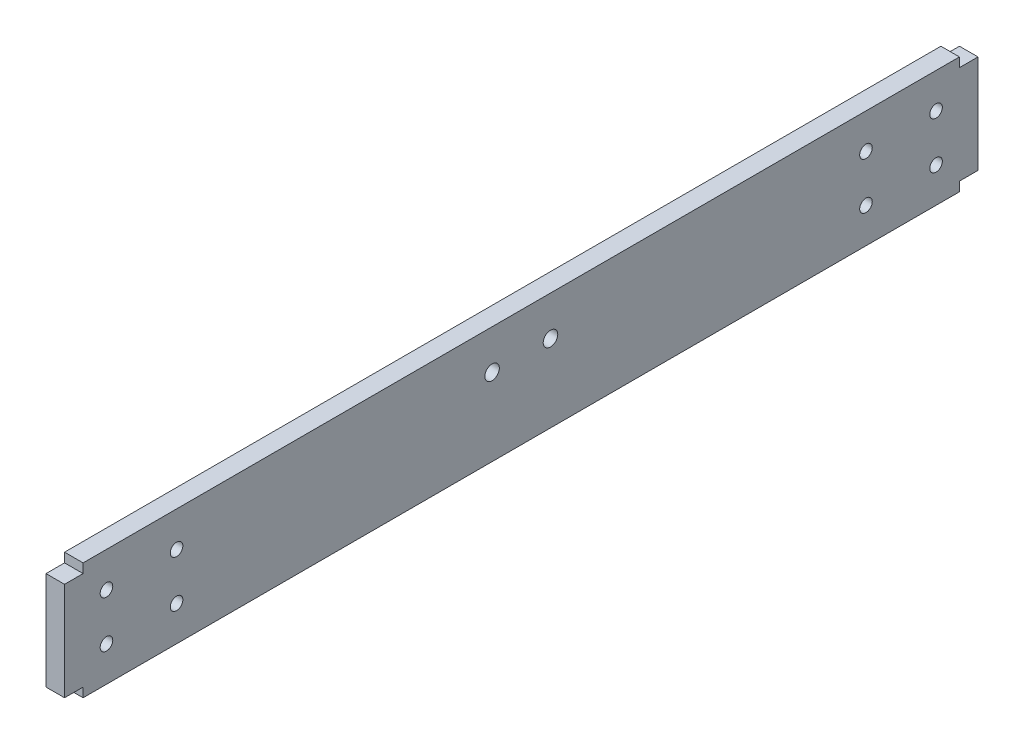
ISO-10303-21;
HEADER;
FILE_DESCRIPTION(('STEP AP214'),'2;1');
FILE_NAME('part.step','',(''),(''),'','','');
FILE_SCHEMA(('AUTOMOTIVE_DESIGN { 1 0 10303 214 1 1 1 1 }'));
ENDSEC;
DATA;
#1=APPLICATION_CONTEXT('core data for automotive mechanical design processes');
#2=APPLICATION_PROTOCOL_DEFINITION('international standard','automotive_design',2000,#1);
#3=PRODUCT_CONTEXT('',#1,'mechanical');
#4=PRODUCT('Part','Part','',(#3));
#5=PRODUCT_RELATED_PRODUCT_CATEGORY('part','',(#4));
#6=PRODUCT_DEFINITION_FORMATION('','',#4);
#7=PRODUCT_DEFINITION_CONTEXT('part definition',#1,'design');
#8=PRODUCT_DEFINITION('design','',#6,#7);
#9=PRODUCT_DEFINITION_SHAPE('','',#8);
#10=(LENGTH_UNIT() NAMED_UNIT(*) SI_UNIT(.MILLI.,.METRE.));
#11=(NAMED_UNIT(*) PLANE_ANGLE_UNIT() SI_UNIT($,.RADIAN.));
#12=(NAMED_UNIT(*) SI_UNIT($,.STERADIAN.) SOLID_ANGLE_UNIT());
#13=UNCERTAINTY_MEASURE_WITH_UNIT(LENGTH_MEASURE(1.E-05),#10,'distance_accuracy_value','');
#14=(GEOMETRIC_REPRESENTATION_CONTEXT(3) GLOBAL_UNCERTAINTY_ASSIGNED_CONTEXT((#13)) GLOBAL_UNIT_ASSIGNED_CONTEXT((#10,
#11,#12)) REPRESENTATION_CONTEXT('',''));
#15=CARTESIAN_POINT('',(0.,0.,0.));
#16=DIRECTION('',(0.,0.,1.));
#17=DIRECTION('',(1.,0.,0.));
#18=AXIS2_PLACEMENT_3D('',#15,#16,#17);
#19=CARTESIAN_POINT('',(6.35,-20.,-150.));
#20=DIRECTION('',(0.,0.,1.));
#21=DIRECTION('',(1.,0.,0.));
#22=AXIS2_PLACEMENT_3D('',#19,#20,#21);
#23=PLANE('',#22);
#24=DIRECTION('',(1.,0.,0.));
#25=VECTOR('',#24,1.);
#26=CARTESIAN_POINT('',(0.,16.825,-150.));
#27=LINE('',#26,#25);
#28=CARTESIAN_POINT('',(0.,16.825,-150.));
#29=VERTEX_POINT('',#28);
#30=CARTESIAN_POINT('',(6.35,16.825,-150.));
#31=VERTEX_POINT('',#30);
#32=EDGE_CURVE('E133',#29,#31,#27,.T.);
#33=ORIENTED_EDGE('',*,*,#32,.F.);
#34=DIRECTION('',(0.,1.,0.));
#35=VECTOR('',#34,1.);
#36=CARTESIAN_POINT('',(0.,-20.,-150.));
#37=LINE('',#36,#35);
#38=CARTESIAN_POINT('',(0.,20.,-150.));
#39=VERTEX_POINT('',#38);
#40=EDGE_CURVE('E145',#29,#39,#37,.T.);
#41=ORIENTED_EDGE('',*,*,#40,.T.);
#42=DIRECTION('',(-1.,0.,0.));
#43=VECTOR('',#42,1.);
#44=CARTESIAN_POINT('',(6.35,20.,-150.));
#45=LINE('',#44,#43);
#46=CARTESIAN_POINT('',(6.35,20.,-150.));
#47=VERTEX_POINT('',#46);
#48=EDGE_CURVE('E41',#47,#39,#45,.T.);
#49=ORIENTED_EDGE('',*,*,#48,.F.);
#50=DIRECTION('',(0.,1.,0.));
#51=VECTOR('',#50,1.);
#52=CARTESIAN_POINT('',(6.35,-20.,-150.));
#53=LINE('',#52,#51);
#54=EDGE_CURVE('E309',#31,#47,#53,.T.);
#55=ORIENTED_EDGE('',*,*,#54,.F.);
#56=EDGE_LOOP('',(#33,#41,#49,#55));
#57=FACE_BOUND('',#56,.T.);
#58=ADVANCED_FACE('F32',(#57),#23,.F.);
#59=CARTESIAN_POINT('',(6.35,-20.,150.));
#60=DIRECTION('',(0.,0.,-1.));
#61=DIRECTION('',(-1.,0.,0.));
#62=AXIS2_PLACEMENT_3D('',#59,#60,#61);
#63=PLANE('',#62);
#64=DIRECTION('',(1.,0.,0.));
#65=VECTOR('',#64,1.);
#66=CARTESIAN_POINT('',(0.,-16.825,150.));
#67=LINE('',#66,#65);
#68=CARTESIAN_POINT('',(0.,-16.825,150.));
#69=VERTEX_POINT('',#68);
#70=CARTESIAN_POINT('',(6.35,-16.825,150.));
#71=VERTEX_POINT('',#70);
#72=EDGE_CURVE('E322',#69,#71,#67,.T.);
#73=ORIENTED_EDGE('',*,*,#72,.F.);
#74=DIRECTION('',(0.,-1.,0.));
#75=VECTOR('',#74,1.);
#76=CARTESIAN_POINT('',(0.,-20.,150.));
#77=LINE('',#76,#75);
#78=CARTESIAN_POINT('',(0.,-20.,150.));
#79=VERTEX_POINT('',#78);
#80=EDGE_CURVE('E256',#69,#79,#77,.T.);
#81=ORIENTED_EDGE('',*,*,#80,.T.);
#82=DIRECTION('',(-1.,0.,0.));
#83=VECTOR('',#82,1.);
#84=CARTESIAN_POINT('',(6.35,-20.,150.));
#85=LINE('',#84,#83);
#86=CARTESIAN_POINT('',(6.35,-20.,150.));
#87=VERTEX_POINT('',#86);
#88=EDGE_CURVE('E272',#87,#79,#85,.T.);
#89=ORIENTED_EDGE('',*,*,#88,.F.);
#90=DIRECTION('',(0.,-1.,0.));
#91=VECTOR('',#90,1.);
#92=CARTESIAN_POINT('',(6.35,-20.,150.));
#93=LINE('',#92,#91);
#94=EDGE_CURVE('E294',#71,#87,#93,.T.);
#95=ORIENTED_EDGE('',*,*,#94,.F.);
#96=EDGE_LOOP('',(#73,#81,#89,#95));
#97=FACE_BOUND('',#96,.T.);
#98=ADVANCED_FACE('F230',(#97),#63,.F.);
#99=CARTESIAN_POINT('',(6.35,-20.,150.));
#100=DIRECTION('',(0.,1.,0.));
#101=DIRECTION('',(0.,0.,1.));
#102=AXIS2_PLACEMENT_3D('',#99,#100,#101);
#103=PLANE('',#102);
#104=DIRECTION('',(0.,0.,-1.));
#105=VECTOR('',#104,1.);
#106=CARTESIAN_POINT('',(0.,-20.,150.));
#107=LINE('',#106,#105);
#108=CARTESIAN_POINT('',(0.,-20.,-150.));
#109=VERTEX_POINT('',#108);
#110=EDGE_CURVE('E258',#79,#109,#107,.T.);
#111=ORIENTED_EDGE('',*,*,#110,.T.);
#112=DIRECTION('',(-1.,0.,0.));
#113=VECTOR('',#112,1.);
#114=CARTESIAN_POINT('',(6.35,-20.,-150.));
#115=LINE('',#114,#113);
#116=CARTESIAN_POINT('',(6.35,-20.,-150.));
#117=VERTEX_POINT('',#116);
#118=EDGE_CURVE('E11',#117,#109,#115,.T.);
#119=ORIENTED_EDGE('',*,*,#118,.F.);
#120=DIRECTION('',(0.,0.,-1.));
#121=VECTOR('',#120,1.);
#122=CARTESIAN_POINT('',(6.35,-20.,150.));
#123=LINE('',#122,#121);
#124=EDGE_CURVE('E280',#87,#117,#123,.T.);
#125=ORIENTED_EDGE('',*,*,#124,.F.);
#126=ORIENTED_EDGE('',*,*,#88,.T.);
#127=EDGE_LOOP('',(#111,#119,#125,#126));
#128=FACE_BOUND('',#127,.T.);
#129=ADVANCED_FACE('F34',(#128),#103,.F.);
#130=CARTESIAN_POINT('',(0.,-16.825,-150.));
#131=VERTEX_POINT('',#130);
#132=EDGE_CURVE('E250',#109,#131,#37,.T.);
#133=ORIENTED_EDGE('',*,*,#132,.T.);
#134=DIRECTION('',(1.,0.,0.));
#135=VECTOR('',#134,1.);
#136=CARTESIAN_POINT('',(0.,-16.825,-150.));
#137=LINE('',#136,#135);
#138=CARTESIAN_POINT('',(6.35,-16.825,-150.));
#139=VERTEX_POINT('',#138);
#140=EDGE_CURVE('E159',#131,#139,#137,.T.);
#141=ORIENTED_EDGE('',*,*,#140,.T.);
#142=EDGE_CURVE('E303',#117,#139,#53,.T.);
#143=ORIENTED_EDGE('',*,*,#142,.F.);
#144=ORIENTED_EDGE('',*,*,#118,.T.);
#145=EDGE_LOOP('',(#133,#141,#143,#144));
#146=FACE_BOUND('',#145,.T.);
#147=ADVANCED_FACE('F232',(#146),#23,.F.);
#148=CARTESIAN_POINT('',(6.35,20.,150.));
#149=DIRECTION('',(0.,-1.,0.));
#150=DIRECTION('',(0.,0.,-1.));
#151=AXIS2_PLACEMENT_3D('',#148,#149,#150);
#152=PLANE('',#151);
#153=DIRECTION('',(0.,0.,1.));
#154=VECTOR('',#153,1.);
#155=CARTESIAN_POINT('',(0.,20.,150.));
#156=LINE('',#155,#154);
#157=CARTESIAN_POINT('',(0.,20.,150.));
#158=VERTEX_POINT('',#157);
#159=EDGE_CURVE('E254',#39,#158,#156,.T.);
#160=ORIENTED_EDGE('',*,*,#159,.T.);
#161=DIRECTION('',(-1.,0.,0.));
#162=VECTOR('',#161,1.);
#163=CARTESIAN_POINT('',(6.35,20.,150.));
#164=LINE('',#163,#162);
#165=CARTESIAN_POINT('',(6.35,20.,150.));
#166=VERTEX_POINT('',#165);
#167=EDGE_CURVE('E283',#166,#158,#164,.T.);
#168=ORIENTED_EDGE('',*,*,#167,.F.);
#169=DIRECTION('',(0.,0.,1.));
#170=VECTOR('',#169,1.);
#171=CARTESIAN_POINT('',(6.35,20.,150.));
#172=LINE('',#171,#170);
#173=EDGE_CURVE('E296',#47,#166,#172,.T.);
#174=ORIENTED_EDGE('',*,*,#173,.F.);
#175=ORIENTED_EDGE('',*,*,#48,.T.);
#176=EDGE_LOOP('',(#160,#168,#174,#175));
#177=FACE_BOUND('',#176,.T.);
#178=ADVANCED_FACE('F241',(#177),#152,.F.);
#179=CARTESIAN_POINT('',(0.,16.825,150.));
#180=VERTEX_POINT('',#179);
#181=EDGE_CURVE('E278',#158,#180,#77,.T.);
#182=ORIENTED_EDGE('',*,*,#181,.T.);
#183=DIRECTION('',(1.,0.,0.));
#184=VECTOR('',#183,1.);
#185=CARTESIAN_POINT('',(0.,16.825,150.));
#186=LINE('',#185,#184);
#187=CARTESIAN_POINT('',(6.35,16.825,150.));
#188=VERTEX_POINT('',#187);
#189=EDGE_CURVE('E318',#180,#188,#186,.T.);
#190=ORIENTED_EDGE('',*,*,#189,.T.);
#191=EDGE_CURVE('E290',#166,#188,#93,.T.);
#192=ORIENTED_EDGE('',*,*,#191,.F.);
#193=ORIENTED_EDGE('',*,*,#167,.T.);
#194=EDGE_LOOP('',(#182,#190,#192,#193));
#195=FACE_BOUND('',#194,.T.);
#196=ADVANCED_FACE('F238',(#195),#63,.F.);
#197=CARTESIAN_POINT('',(6.35,0.,0.));
#198=DIRECTION('',(1.,0.,0.));
#199=DIRECTION('',(0.,0.,-1.));
#200=AXIS2_PLACEMENT_3D('',#197,#198,#199);
#201=PLANE('',#200);
#202=CARTESIAN_POINT('',(6.35,8.,142.));
#203=DIRECTION('',(1.,0.,0.));
#204=DIRECTION('',(0.,0.,-1.));
#205=AXIS2_PLACEMENT_3D('',#202,#203,#204);
#206=CIRCLE('',#205,2.15264999999999);
#207=CARTESIAN_POINT('',(6.35,8.,139.84735));
#208=VERTEX_POINT('',#207);
#209=EDGE_CURVE('E493',#208,#208,#206,.T.);
#210=ORIENTED_EDGE('',*,*,#209,.F.);
#211=EDGE_LOOP('',(#210));
#212=FACE_BOUND('',#211,.T.);
#213=CARTESIAN_POINT('',(6.35,8.,118.));
#214=DIRECTION('',(1.,0.,0.));
#215=DIRECTION('',(0.,0.,-1.));
#216=AXIS2_PLACEMENT_3D('',#213,#214,#215);
#217=CIRCLE('',#216,2.15264999999999);
#218=CARTESIAN_POINT('',(6.35,8.,115.84735));
#219=VERTEX_POINT('',#218);
#220=EDGE_CURVE('E497',#219,#219,#217,.T.);
#221=ORIENTED_EDGE('',*,*,#220,.F.);
#222=EDGE_LOOP('',(#221));
#223=FACE_BOUND('',#222,.T.);
#224=CARTESIAN_POINT('',(6.35,-8.,118.));
#225=DIRECTION('',(1.,0.,0.));
#226=DIRECTION('',(0.,0.,-1.));
#227=AXIS2_PLACEMENT_3D('',#224,#225,#226);
#228=CIRCLE('',#227,2.15264999999999);
#229=CARTESIAN_POINT('',(6.35,-8.,115.84735));
#230=VERTEX_POINT('',#229);
#231=EDGE_CURVE('E506',#230,#230,#228,.T.);
#232=ORIENTED_EDGE('',*,*,#231,.F.);
#233=EDGE_LOOP('',(#232));
#234=FACE_BOUND('',#233,.T.);
#235=CARTESIAN_POINT('',(6.35,-8.,142.));
#236=DIRECTION('',(1.,0.,0.));
#237=DIRECTION('',(0.,0.,-1.));
#238=AXIS2_PLACEMENT_3D('',#235,#236,#237);
#239=CIRCLE('',#238,2.15264999999999);
#240=CARTESIAN_POINT('',(6.35,-8.,139.84735));
#241=VERTEX_POINT('',#240);
#242=EDGE_CURVE('E509',#241,#241,#239,.T.);
#243=ORIENTED_EDGE('',*,*,#242,.F.);
#244=EDGE_LOOP('',(#243));
#245=FACE_BOUND('',#244,.T.);
#246=CARTESIAN_POINT('',(6.35,7.99999999999998,-118.));
#247=DIRECTION('',(1.,0.,0.));
#248=DIRECTION('',(0.,0.,-1.));
#249=AXIS2_PLACEMENT_3D('',#246,#247,#248);
#250=CIRCLE('',#249,2.15264999999999);
#251=CARTESIAN_POINT('',(6.35,7.99999999999998,-120.15265));
#252=VERTEX_POINT('',#251);
#253=EDGE_CURVE('E195',#252,#252,#250,.T.);
#254=ORIENTED_EDGE('',*,*,#253,.F.);
#255=EDGE_LOOP('',(#254));
#256=FACE_BOUND('',#255,.T.);
#257=CARTESIAN_POINT('',(6.35,7.99999999999999,-142.));
#258=DIRECTION('',(1.,0.,0.));
#259=DIRECTION('',(0.,0.,-1.));
#260=AXIS2_PLACEMENT_3D('',#257,#258,#259);
#261=CIRCLE('',#260,2.15264999999999);
#262=CARTESIAN_POINT('',(6.35,7.99999999999999,-144.15265));
#263=VERTEX_POINT('',#262);
#264=EDGE_CURVE('E183',#263,#263,#261,.T.);
#265=ORIENTED_EDGE('',*,*,#264,.F.);
#266=EDGE_LOOP('',(#265));
#267=FACE_BOUND('',#266,.T.);
#268=CARTESIAN_POINT('',(6.35,-8.00000000000001,-142.));
#269=DIRECTION('',(1.,0.,0.));
#270=DIRECTION('',(0.,0.,-1.));
#271=AXIS2_PLACEMENT_3D('',#268,#269,#270);
#272=CIRCLE('',#271,2.15264999999999);
#273=CARTESIAN_POINT('',(6.35,-8.00000000000001,-144.15265));
#274=VERTEX_POINT('',#273);
#275=EDGE_CURVE('E182',#274,#274,#272,.T.);
#276=ORIENTED_EDGE('',*,*,#275,.F.);
#277=EDGE_LOOP('',(#276));
#278=FACE_BOUND('',#277,.T.);
#279=CARTESIAN_POINT('',(6.35,-8.00000000000002,-118.));
#280=DIRECTION('',(1.,0.,0.));
#281=DIRECTION('',(0.,0.,-1.));
#282=AXIS2_PLACEMENT_3D('',#279,#280,#281);
#283=CIRCLE('',#282,2.15264999999999);
#284=CARTESIAN_POINT('',(6.35,-8.00000000000002,-120.15265));
#285=VERTEX_POINT('',#284);
#286=EDGE_CURVE('E179',#285,#285,#283,.T.);
#287=ORIENTED_EDGE('',*,*,#286,.F.);
#288=EDGE_LOOP('',(#287));
#289=FACE_BOUND('',#288,.T.);
#290=CARTESIAN_POINT('',(6.35,6.5,10.));
#291=DIRECTION('',(1.,0.,0.));
#292=DIRECTION('',(0.,0.,-1.));
#293=AXIS2_PLACEMENT_3D('',#290,#291,#292);
#294=CIRCLE('',#293,2.4892);
#295=CARTESIAN_POINT('',(6.35,6.5,7.5108));
#296=VERTEX_POINT('',#295);
#297=EDGE_CURVE('E178',#296,#296,#294,.T.);
#298=ORIENTED_EDGE('',*,*,#297,.F.);
#299=EDGE_LOOP('',(#298));
#300=FACE_BOUND('',#299,.T.);
#301=CARTESIAN_POINT('',(6.35,6.5,-10.));
#302=DIRECTION('',(1.,0.,0.));
#303=DIRECTION('',(0.,0.,-1.));
#304=AXIS2_PLACEMENT_3D('',#301,#302,#303);
#305=CIRCLE('',#304,2.4892);
#306=CARTESIAN_POINT('',(6.35,6.5,-12.4892));
#307=VERTEX_POINT('',#306);
#308=EDGE_CURVE('E207',#307,#307,#305,.T.);
#309=ORIENTED_EDGE('',*,*,#308,.F.);
#310=EDGE_LOOP('',(#309));
#311=FACE_BOUND('',#310,.T.);
#312=ORIENTED_EDGE('',*,*,#124,.T.);
#313=ORIENTED_EDGE('',*,*,#142,.T.);
#314=DIRECTION('',(0.,0.,-1.));
#315=VECTOR('',#314,1.);
#316=CARTESIAN_POINT('',(6.35,-16.825,-156.35));
#317=LINE('',#316,#315);
#318=CARTESIAN_POINT('',(6.35,-16.825,-156.35));
#319=VERTEX_POINT('',#318);
#320=EDGE_CURVE('E49',#139,#319,#317,.T.);
#321=ORIENTED_EDGE('',*,*,#320,.T.);
#322=DIRECTION('',(0.,1.,0.));
#323=VECTOR('',#322,1.);
#324=CARTESIAN_POINT('',(6.35,16.825,-156.35));
#325=LINE('',#324,#323);
#326=CARTESIAN_POINT('',(6.35,16.825,-156.35));
#327=VERTEX_POINT('',#326);
#328=EDGE_CURVE('E155',#319,#327,#325,.T.);
#329=ORIENTED_EDGE('',*,*,#328,.T.);
#330=DIRECTION('',(0.,0.,1.));
#331=VECTOR('',#330,1.);
#332=CARTESIAN_POINT('',(6.35,16.825,-156.35));
#333=LINE('',#332,#331);
#334=EDGE_CURVE('E128',#327,#31,#333,.T.);
#335=ORIENTED_EDGE('',*,*,#334,.T.);
#336=ORIENTED_EDGE('',*,*,#54,.T.);
#337=ORIENTED_EDGE('',*,*,#173,.T.);
#338=ORIENTED_EDGE('',*,*,#191,.T.);
#339=DIRECTION('',(0.,0.,1.));
#340=VECTOR('',#339,1.);
#341=CARTESIAN_POINT('',(6.35,16.825,156.35));
#342=LINE('',#341,#340);
#343=CARTESIAN_POINT('',(6.35,16.825,156.35));
#344=VERTEX_POINT('',#343);
#345=EDGE_CURVE('E57',#188,#344,#342,.T.);
#346=ORIENTED_EDGE('',*,*,#345,.T.);
#347=DIRECTION('',(0.,-1.,0.));
#348=VECTOR('',#347,1.);
#349=CARTESIAN_POINT('',(6.35,16.825,156.35));
#350=LINE('',#349,#348);
#351=CARTESIAN_POINT('',(6.35,-16.825,156.35));
#352=VERTEX_POINT('',#351);
#353=EDGE_CURVE('E158',#344,#352,#350,.T.);
#354=ORIENTED_EDGE('',*,*,#353,.T.);
#355=DIRECTION('',(0.,0.,-1.));
#356=VECTOR('',#355,1.);
#357=CARTESIAN_POINT('',(6.35,-16.825,156.35));
#358=LINE('',#357,#356);
#359=EDGE_CURVE('E343',#352,#71,#358,.T.);
#360=ORIENTED_EDGE('',*,*,#359,.T.);
#361=ORIENTED_EDGE('',*,*,#94,.T.);
#362=EDGE_LOOP('',(#312,#313,#321,#329,#335,#336,#337,#338,#346,#354,#360,#361));
#363=FACE_BOUND('',#362,.T.);
#364=ADVANCED_FACE('F313',(#212,#223,#234,#245,#256,#267,#278,#289,#300,#311,#363),#201,.T.);
#365=CARTESIAN_POINT('',(0.,0.,0.));
#366=DIRECTION('',(1.,0.,0.));
#367=DIRECTION('',(0.,0.,-1.));
#368=AXIS2_PLACEMENT_3D('',#365,#366,#367);
#369=PLANE('',#368);
#370=CARTESIAN_POINT('',(0.,8.,142.));
#371=DIRECTION('',(1.,0.,0.));
#372=DIRECTION('',(0.,0.,-1.));
#373=AXIS2_PLACEMENT_3D('',#370,#371,#372);
#374=CIRCLE('',#373,2.15264999999999);
#375=CARTESIAN_POINT('',(0.,8.,139.84735));
#376=VERTEX_POINT('',#375);
#377=EDGE_CURVE('E496',#376,#376,#374,.T.);
#378=ORIENTED_EDGE('',*,*,#377,.T.);
#379=EDGE_LOOP('',(#378));
#380=FACE_BOUND('',#379,.T.);
#381=CARTESIAN_POINT('',(0.,8.,118.));
#382=DIRECTION('',(1.,0.,0.));
#383=DIRECTION('',(0.,0.,-1.));
#384=AXIS2_PLACEMENT_3D('',#381,#382,#383);
#385=CIRCLE('',#384,2.15264999999999);
#386=CARTESIAN_POINT('',(0.,8.,115.84735));
#387=VERTEX_POINT('',#386);
#388=EDGE_CURVE('E500',#387,#387,#385,.T.);
#389=ORIENTED_EDGE('',*,*,#388,.T.);
#390=EDGE_LOOP('',(#389));
#391=FACE_BOUND('',#390,.T.);
#392=CARTESIAN_POINT('',(0.,-8.,118.));
#393=DIRECTION('',(1.,0.,0.));
#394=DIRECTION('',(0.,0.,-1.));
#395=AXIS2_PLACEMENT_3D('',#392,#393,#394);
#396=CIRCLE('',#395,2.15264999999999);
#397=CARTESIAN_POINT('',(0.,-8.,115.84735));
#398=VERTEX_POINT('',#397);
#399=EDGE_CURVE('E36',#398,#398,#396,.T.);
#400=ORIENTED_EDGE('',*,*,#399,.T.);
#401=EDGE_LOOP('',(#400));
#402=FACE_BOUND('',#401,.T.);
#403=CARTESIAN_POINT('',(0.,-8.,142.));
#404=DIRECTION('',(1.,0.,0.));
#405=DIRECTION('',(0.,0.,-1.));
#406=AXIS2_PLACEMENT_3D('',#403,#404,#405);
#407=CIRCLE('',#406,2.15264999999999);
#408=CARTESIAN_POINT('',(0.,-8.,139.84735));
#409=VERTEX_POINT('',#408);
#410=EDGE_CURVE('E512',#409,#409,#407,.T.);
#411=ORIENTED_EDGE('',*,*,#410,.T.);
#412=EDGE_LOOP('',(#411));
#413=FACE_BOUND('',#412,.T.);
#414=CARTESIAN_POINT('',(0.,7.99999999999998,-118.));
#415=DIRECTION('',(1.,0.,0.));
#416=DIRECTION('',(0.,0.,-1.));
#417=AXIS2_PLACEMENT_3D('',#414,#415,#416);
#418=CIRCLE('',#417,2.15264999999999);
#419=CARTESIAN_POINT('',(0.,7.99999999999998,-120.15265));
#420=VERTEX_POINT('',#419);
#421=EDGE_CURVE('E190',#420,#420,#418,.T.);
#422=ORIENTED_EDGE('',*,*,#421,.T.);
#423=EDGE_LOOP('',(#422));
#424=FACE_BOUND('',#423,.T.);
#425=CARTESIAN_POINT('',(0.,7.99999999999999,-142.));
#426=DIRECTION('',(1.,0.,0.));
#427=DIRECTION('',(0.,0.,-1.));
#428=AXIS2_PLACEMENT_3D('',#425,#426,#427);
#429=CIRCLE('',#428,2.15264999999999);
#430=CARTESIAN_POINT('',(0.,7.99999999999999,-144.15265));
#431=VERTEX_POINT('',#430);
#432=EDGE_CURVE('E180',#431,#431,#429,.T.);
#433=ORIENTED_EDGE('',*,*,#432,.T.);
#434=EDGE_LOOP('',(#433));
#435=FACE_BOUND('',#434,.T.);
#436=CARTESIAN_POINT('',(0.,-8.00000000000001,-142.));
#437=DIRECTION('',(1.,0.,0.));
#438=DIRECTION('',(0.,0.,-1.));
#439=AXIS2_PLACEMENT_3D('',#436,#437,#438);
#440=CIRCLE('',#439,2.15264999999999);
#441=CARTESIAN_POINT('',(0.,-8.00000000000001,-144.15265));
#442=VERTEX_POINT('',#441);
#443=EDGE_CURVE('E187',#442,#442,#440,.T.);
#444=ORIENTED_EDGE('',*,*,#443,.T.);
#445=EDGE_LOOP('',(#444));
#446=FACE_BOUND('',#445,.T.);
#447=CARTESIAN_POINT('',(0.,-8.00000000000002,-118.));
#448=DIRECTION('',(1.,0.,0.));
#449=DIRECTION('',(0.,0.,-1.));
#450=AXIS2_PLACEMENT_3D('',#447,#448,#449);
#451=CIRCLE('',#450,2.15264999999999);
#452=CARTESIAN_POINT('',(0.,-8.00000000000002,-120.15265));
#453=VERTEX_POINT('',#452);
#454=EDGE_CURVE('E176',#453,#453,#451,.T.);
#455=ORIENTED_EDGE('',*,*,#454,.T.);
#456=EDGE_LOOP('',(#455));
#457=FACE_BOUND('',#456,.T.);
#458=CARTESIAN_POINT('',(0.,6.5,10.));
#459=DIRECTION('',(1.,0.,0.));
#460=DIRECTION('',(0.,0.,-1.));
#461=AXIS2_PLACEMENT_3D('',#458,#459,#460);
#462=CIRCLE('',#461,2.4892);
#463=CARTESIAN_POINT('',(0.,6.5,7.5108));
#464=VERTEX_POINT('',#463);
#465=EDGE_CURVE('E205',#464,#464,#462,.T.);
#466=ORIENTED_EDGE('',*,*,#465,.T.);
#467=EDGE_LOOP('',(#466));
#468=FACE_BOUND('',#467,.T.);
#469=CARTESIAN_POINT('',(0.,6.5,-10.));
#470=DIRECTION('',(1.,0.,0.));
#471=DIRECTION('',(0.,0.,-1.));
#472=AXIS2_PLACEMENT_3D('',#469,#470,#471);
#473=CIRCLE('',#472,2.4892);
#474=CARTESIAN_POINT('',(0.,6.5,-12.4892));
#475=VERTEX_POINT('',#474);
#476=EDGE_CURVE('E153',#475,#475,#473,.T.);
#477=ORIENTED_EDGE('',*,*,#476,.T.);
#478=EDGE_LOOP('',(#477));
#479=FACE_BOUND('',#478,.T.);
#480=ORIENTED_EDGE('',*,*,#110,.F.);
#481=ORIENTED_EDGE('',*,*,#80,.F.);
#482=DIRECTION('',(0.,0.,-1.));
#483=VECTOR('',#482,1.);
#484=CARTESIAN_POINT('',(0.,-16.825,156.35));
#485=LINE('',#484,#483);
#486=CARTESIAN_POINT('',(0.,-16.825,156.35));
#487=VERTEX_POINT('',#486);
#488=EDGE_CURVE('E336',#487,#69,#485,.T.);
#489=ORIENTED_EDGE('',*,*,#488,.F.);
#490=DIRECTION('',(0.,-1.,0.));
#491=VECTOR('',#490,1.);
#492=CARTESIAN_POINT('',(0.,16.825,156.35));
#493=LINE('',#492,#491);
#494=CARTESIAN_POINT('',(0.,16.825,156.35));
#495=VERTEX_POINT('',#494);
#496=EDGE_CURVE('E341',#495,#487,#493,.T.);
#497=ORIENTED_EDGE('',*,*,#496,.F.);
#498=DIRECTION('',(0.,0.,1.));
#499=VECTOR('',#498,1.);
#500=CARTESIAN_POINT('',(0.,16.825,156.35));
#501=LINE('',#500,#499);
#502=EDGE_CURVE('E333',#180,#495,#501,.T.);
#503=ORIENTED_EDGE('',*,*,#502,.F.);
#504=ORIENTED_EDGE('',*,*,#181,.F.);
#505=ORIENTED_EDGE('',*,*,#159,.F.);
#506=ORIENTED_EDGE('',*,*,#40,.F.);
#507=DIRECTION('',(0.,0.,1.));
#508=VECTOR('',#507,1.);
#509=CARTESIAN_POINT('',(0.,16.825,-156.35));
#510=LINE('',#509,#508);
#511=CARTESIAN_POINT('',(0.,16.825,-156.35));
#512=VERTEX_POINT('',#511);
#513=EDGE_CURVE('E125',#512,#29,#510,.T.);
#514=ORIENTED_EDGE('',*,*,#513,.F.);
#515=DIRECTION('',(0.,1.,0.));
#516=VECTOR('',#515,1.);
#517=CARTESIAN_POINT('',(0.,16.825,-156.35));
#518=LINE('',#517,#516);
#519=CARTESIAN_POINT('',(0.,-16.825,-156.35));
#520=VERTEX_POINT('',#519);
#521=EDGE_CURVE('E142',#520,#512,#518,.T.);
#522=ORIENTED_EDGE('',*,*,#521,.F.);
#523=DIRECTION('',(0.,0.,-1.));
#524=VECTOR('',#523,1.);
#525=CARTESIAN_POINT('',(0.,-16.825,-156.35));
#526=LINE('',#525,#524);
#527=EDGE_CURVE('E134',#131,#520,#526,.T.);
#528=ORIENTED_EDGE('',*,*,#527,.F.);
#529=ORIENTED_EDGE('',*,*,#132,.F.);
#530=EDGE_LOOP('',(#480,#481,#489,#497,#503,#504,#505,#506,#514,#522,#528,#529));
#531=FACE_BOUND('',#530,.T.);
#532=ADVANCED_FACE('F140',(#380,#391,#402,#413,#424,#435,#446,#457,#468,#479,#531),#369,.F.);
#533=CARTESIAN_POINT('',(0.,16.825,156.35));
#534=DIRECTION('',(0.,0.,1.));
#535=DIRECTION('',(1.,0.,0.));
#536=AXIS2_PLACEMENT_3D('',#533,#534,#535);
#537=PLANE('',#536);
#538=ORIENTED_EDGE('',*,*,#353,.F.);
#539=DIRECTION('',(1.,0.,0.));
#540=VECTOR('',#539,1.);
#541=CARTESIAN_POINT('',(0.,16.825,156.35));
#542=LINE('',#541,#540);
#543=EDGE_CURVE('E317',#495,#344,#542,.T.);
#544=ORIENTED_EDGE('',*,*,#543,.F.);
#545=ORIENTED_EDGE('',*,*,#496,.T.);
#546=DIRECTION('',(1.,0.,0.));
#547=VECTOR('',#546,1.);
#548=CARTESIAN_POINT('',(0.,-16.825,156.35));
#549=LINE('',#548,#547);
#550=EDGE_CURVE('E335',#487,#352,#549,.T.);
#551=ORIENTED_EDGE('',*,*,#550,.T.);
#552=EDGE_LOOP('',(#538,#544,#545,#551));
#553=FACE_BOUND('',#552,.T.);
#554=ADVANCED_FACE('F347',(#553),#537,.T.);
#555=CARTESIAN_POINT('',(0.,16.825,156.35));
#556=DIRECTION('',(0.,1.,0.));
#557=DIRECTION('',(0.,0.,1.));
#558=AXIS2_PLACEMENT_3D('',#555,#556,#557);
#559=PLANE('',#558);
#560=ORIENTED_EDGE('',*,*,#345,.F.);
#561=ORIENTED_EDGE('',*,*,#189,.F.);
#562=ORIENTED_EDGE('',*,*,#502,.T.);
#563=ORIENTED_EDGE('',*,*,#543,.T.);
#564=EDGE_LOOP('',(#560,#561,#562,#563));
#565=FACE_BOUND('',#564,.T.);
#566=ADVANCED_FACE('F355',(#565),#559,.T.);
#567=CARTESIAN_POINT('',(0.,-16.825,156.35));
#568=DIRECTION('',(0.,-1.,0.));
#569=DIRECTION('',(0.,0.,-1.));
#570=AXIS2_PLACEMENT_3D('',#567,#568,#569);
#571=PLANE('',#570);
#572=ORIENTED_EDGE('',*,*,#359,.F.);
#573=ORIENTED_EDGE('',*,*,#550,.F.);
#574=ORIENTED_EDGE('',*,*,#488,.T.);
#575=ORIENTED_EDGE('',*,*,#72,.T.);
#576=EDGE_LOOP('',(#572,#573,#574,#575));
#577=FACE_BOUND('',#576,.T.);
#578=ADVANCED_FACE('F352',(#577),#571,.T.);
#579=CARTESIAN_POINT('',(0.,16.825,-156.35));
#580=DIRECTION('',(0.,0.,-1.));
#581=DIRECTION('',(-1.,0.,0.));
#582=AXIS2_PLACEMENT_3D('',#579,#580,#581);
#583=PLANE('',#582);
#584=ORIENTED_EDGE('',*,*,#328,.F.);
#585=DIRECTION('',(1.,0.,0.));
#586=VECTOR('',#585,1.);
#587=CARTESIAN_POINT('',(0.,-16.825,-156.35));
#588=LINE('',#587,#586);
#589=EDGE_CURVE('E148',#520,#319,#588,.T.);
#590=ORIENTED_EDGE('',*,*,#589,.F.);
#591=ORIENTED_EDGE('',*,*,#521,.T.);
#592=DIRECTION('',(1.,0.,0.));
#593=VECTOR('',#592,1.);
#594=CARTESIAN_POINT('',(0.,16.825,-156.35));
#595=LINE('',#594,#593);
#596=EDGE_CURVE('E122',#512,#327,#595,.T.);
#597=ORIENTED_EDGE('',*,*,#596,.T.);
#598=EDGE_LOOP('',(#584,#590,#591,#597));
#599=FACE_BOUND('',#598,.T.);
#600=ADVANCED_FACE('F147',(#599),#583,.T.);
#601=CARTESIAN_POINT('',(0.,-16.825,-156.35));
#602=DIRECTION('',(0.,-1.,0.));
#603=DIRECTION('',(0.,0.,-1.));
#604=AXIS2_PLACEMENT_3D('',#601,#602,#603);
#605=PLANE('',#604);
#606=ORIENTED_EDGE('',*,*,#320,.F.);
#607=ORIENTED_EDGE('',*,*,#140,.F.);
#608=ORIENTED_EDGE('',*,*,#527,.T.);
#609=ORIENTED_EDGE('',*,*,#589,.T.);
#610=EDGE_LOOP('',(#606,#607,#608,#609));
#611=FACE_BOUND('',#610,.T.);
#612=ADVANCED_FACE('F226',(#611),#605,.T.);
#613=CARTESIAN_POINT('',(0.,16.825,-156.35));
#614=DIRECTION('',(0.,1.,0.));
#615=DIRECTION('',(0.,0.,1.));
#616=AXIS2_PLACEMENT_3D('',#613,#614,#615);
#617=PLANE('',#616);
#618=ORIENTED_EDGE('',*,*,#334,.F.);
#619=ORIENTED_EDGE('',*,*,#596,.F.);
#620=ORIENTED_EDGE('',*,*,#513,.T.);
#621=ORIENTED_EDGE('',*,*,#32,.T.);
#622=EDGE_LOOP('',(#618,#619,#620,#621));
#623=FACE_BOUND('',#622,.T.);
#624=ADVANCED_FACE('F124',(#623),#617,.T.);
#625=CARTESIAN_POINT('',(6.35,6.5,-10.));
#626=DIRECTION('',(1.,0.,0.));
#627=DIRECTION('',(0.,0.,-1.));
#628=AXIS2_PLACEMENT_3D('',#625,#626,#627);
#629=CYLINDRICAL_SURFACE('',#628,2.4892);
#630=ORIENTED_EDGE('',*,*,#308,.T.);
#631=EDGE_LOOP('',(#630));
#632=FACE_BOUND('',#631,.T.);
#633=ORIENTED_EDGE('',*,*,#476,.F.);
#634=EDGE_LOOP('',(#633));
#635=FACE_BOUND('',#634,.T.);
#636=ADVANCED_FACE('F215',(#632,#635),#629,.F.);
#637=CARTESIAN_POINT('',(6.35,6.5,10.));
#638=DIRECTION('',(1.,0.,0.));
#639=DIRECTION('',(0.,0.,-1.));
#640=AXIS2_PLACEMENT_3D('',#637,#638,#639);
#641=CYLINDRICAL_SURFACE('',#640,2.4892);
#642=ORIENTED_EDGE('',*,*,#297,.T.);
#643=EDGE_LOOP('',(#642));
#644=FACE_BOUND('',#643,.T.);
#645=ORIENTED_EDGE('',*,*,#465,.F.);
#646=EDGE_LOOP('',(#645));
#647=FACE_BOUND('',#646,.T.);
#648=ADVANCED_FACE('F217',(#644,#647),#641,.F.);
#649=CARTESIAN_POINT('',(6.35,-8.00000000000002,-118.));
#650=DIRECTION('',(1.,0.,0.));
#651=DIRECTION('',(0.,0.,-1.));
#652=AXIS2_PLACEMENT_3D('',#649,#650,#651);
#653=CYLINDRICAL_SURFACE('',#652,2.15264999999999);
#654=ORIENTED_EDGE('',*,*,#286,.T.);
#655=EDGE_LOOP('',(#654));
#656=FACE_BOUND('',#655,.T.);
#657=ORIENTED_EDGE('',*,*,#454,.F.);
#658=EDGE_LOOP('',(#657));
#659=FACE_BOUND('',#658,.T.);
#660=ADVANCED_FACE('F223',(#656,#659),#653,.F.);
#661=CARTESIAN_POINT('',(6.35,-8.00000000000001,-142.));
#662=DIRECTION('',(1.,0.,0.));
#663=DIRECTION('',(0.,0.,-1.));
#664=AXIS2_PLACEMENT_3D('',#661,#662,#663);
#665=CYLINDRICAL_SURFACE('',#664,2.15264999999999);
#666=ORIENTED_EDGE('',*,*,#275,.T.);
#667=EDGE_LOOP('',(#666));
#668=FACE_BOUND('',#667,.T.);
#669=ORIENTED_EDGE('',*,*,#443,.F.);
#670=EDGE_LOOP('',(#669));
#671=FACE_BOUND('',#670,.T.);
#672=ADVANCED_FACE('F417',(#668,#671),#665,.F.);
#673=CARTESIAN_POINT('',(6.35,7.99999999999999,-142.));
#674=DIRECTION('',(1.,0.,0.));
#675=DIRECTION('',(0.,0.,-1.));
#676=AXIS2_PLACEMENT_3D('',#673,#674,#675);
#677=CYLINDRICAL_SURFACE('',#676,2.15264999999999);
#678=ORIENTED_EDGE('',*,*,#264,.T.);
#679=EDGE_LOOP('',(#678));
#680=FACE_BOUND('',#679,.T.);
#681=ORIENTED_EDGE('',*,*,#432,.F.);
#682=EDGE_LOOP('',(#681));
#683=FACE_BOUND('',#682,.T.);
#684=ADVANCED_FACE('F427',(#680,#683),#677,.F.);
#685=CARTESIAN_POINT('',(6.35,7.99999999999998,-118.));
#686=DIRECTION('',(1.,0.,0.));
#687=DIRECTION('',(0.,0.,-1.));
#688=AXIS2_PLACEMENT_3D('',#685,#686,#687);
#689=CYLINDRICAL_SURFACE('',#688,2.15264999999999);
#690=ORIENTED_EDGE('',*,*,#253,.T.);
#691=EDGE_LOOP('',(#690));
#692=FACE_BOUND('',#691,.T.);
#693=ORIENTED_EDGE('',*,*,#421,.F.);
#694=EDGE_LOOP('',(#693));
#695=FACE_BOUND('',#694,.T.);
#696=ADVANCED_FACE('F437',(#692,#695),#689,.F.);
#697=CARTESIAN_POINT('',(6.35,-8.,142.));
#698=DIRECTION('',(1.,0.,0.));
#699=DIRECTION('',(0.,0.,-1.));
#700=AXIS2_PLACEMENT_3D('',#697,#698,#699);
#701=CYLINDRICAL_SURFACE('',#700,2.15264999999999);
#702=ORIENTED_EDGE('',*,*,#242,.T.);
#703=EDGE_LOOP('',(#702));
#704=FACE_BOUND('',#703,.T.);
#705=ORIENTED_EDGE('',*,*,#410,.F.);
#706=EDGE_LOOP('',(#705));
#707=FACE_BOUND('',#706,.T.);
#708=ADVANCED_FACE('F446',(#704,#707),#701,.F.);
#709=CARTESIAN_POINT('',(6.35,-8.,118.));
#710=DIRECTION('',(1.,0.,0.));
#711=DIRECTION('',(0.,0.,-1.));
#712=AXIS2_PLACEMENT_3D('',#709,#710,#711);
#713=CYLINDRICAL_SURFACE('',#712,2.15264999999999);
#714=ORIENTED_EDGE('',*,*,#231,.T.);
#715=EDGE_LOOP('',(#714));
#716=FACE_BOUND('',#715,.T.);
#717=ORIENTED_EDGE('',*,*,#399,.F.);
#718=EDGE_LOOP('',(#717));
#719=FACE_BOUND('',#718,.T.);
#720=ADVANCED_FACE('F456',(#716,#719),#713,.F.);
#721=CARTESIAN_POINT('',(6.35,8.,118.));
#722=DIRECTION('',(1.,0.,0.));
#723=DIRECTION('',(0.,0.,-1.));
#724=AXIS2_PLACEMENT_3D('',#721,#722,#723);
#725=CYLINDRICAL_SURFACE('',#724,2.15264999999999);
#726=ORIENTED_EDGE('',*,*,#220,.T.);
#727=EDGE_LOOP('',(#726));
#728=FACE_BOUND('',#727,.T.);
#729=ORIENTED_EDGE('',*,*,#388,.F.);
#730=EDGE_LOOP('',(#729));
#731=FACE_BOUND('',#730,.T.);
#732=ADVANCED_FACE('F466',(#728,#731),#725,.F.);
#733=CARTESIAN_POINT('',(6.35,8.,142.));
#734=DIRECTION('',(1.,0.,0.));
#735=DIRECTION('',(0.,0.,-1.));
#736=AXIS2_PLACEMENT_3D('',#733,#734,#735);
#737=CYLINDRICAL_SURFACE('',#736,2.15264999999999);
#738=ORIENTED_EDGE('',*,*,#209,.T.);
#739=EDGE_LOOP('',(#738));
#740=FACE_BOUND('',#739,.T.);
#741=ORIENTED_EDGE('',*,*,#377,.F.);
#742=EDGE_LOOP('',(#741));
#743=FACE_BOUND('',#742,.T.);
#744=ADVANCED_FACE('F476',(#740,#743),#737,.F.);
#745=CLOSED_SHELL('',(#58,#98,#129,#147,#178,#196,#364,#532,#554,#566,#578,#600,#612,#624,#636,
#648,#660,#672,#684,#696,#708,#720,#732,#744));
#746=MANIFOLD_SOLID_BREP('B2',#745);
#747=ADVANCED_BREP_SHAPE_REPRESENTATION('',(#18,#746),#14);
#748=SHAPE_DEFINITION_REPRESENTATION(#9,#747);
ENDSEC;
END-ISO-10303-21;
